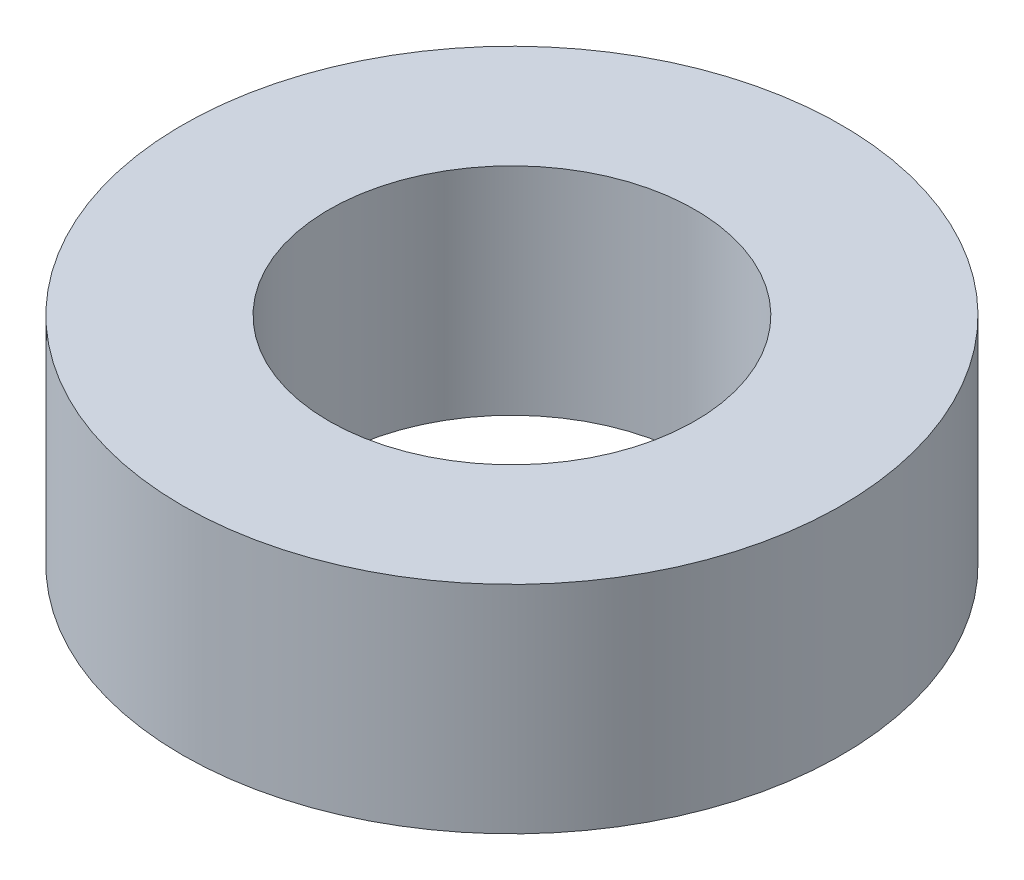
ISO-10303-21;
HEADER;
FILE_DESCRIPTION(('STEP AP214'),'2;1');
FILE_NAME('part.step','',(''),(''),'','','');
FILE_SCHEMA(('AUTOMOTIVE_DESIGN { 1 0 10303 214 1 1 1 1 }'));
ENDSEC;
DATA;
#1=APPLICATION_CONTEXT('core data for automotive mechanical design processes');
#2=APPLICATION_PROTOCOL_DEFINITION('international standard','automotive_design',2000,#1);
#3=PRODUCT_CONTEXT('',#1,'mechanical');
#4=PRODUCT('Part','Part','',(#3));
#5=PRODUCT_RELATED_PRODUCT_CATEGORY('part','',(#4));
#6=PRODUCT_DEFINITION_FORMATION('','',#4);
#7=PRODUCT_DEFINITION_CONTEXT('part definition',#1,'design');
#8=PRODUCT_DEFINITION('design','',#6,#7);
#9=PRODUCT_DEFINITION_SHAPE('','',#8);
#10=(LENGTH_UNIT() NAMED_UNIT(*) SI_UNIT(.MILLI.,.METRE.));
#11=(NAMED_UNIT(*) PLANE_ANGLE_UNIT() SI_UNIT($,.RADIAN.));
#12=(NAMED_UNIT(*) SI_UNIT($,.STERADIAN.) SOLID_ANGLE_UNIT());
#13=UNCERTAINTY_MEASURE_WITH_UNIT(LENGTH_MEASURE(1.E-05),#10,'distance_accuracy_value','');
#14=(GEOMETRIC_REPRESENTATION_CONTEXT(3) GLOBAL_UNCERTAINTY_ASSIGNED_CONTEXT((#13)) GLOBAL_UNIT_ASSIGNED_CONTEXT((#10,
#11,#12)) REPRESENTATION_CONTEXT('',''));
#15=CARTESIAN_POINT('',(0.,0.,0.));
#16=DIRECTION('',(0.,0.,1.));
#17=DIRECTION('',(1.,0.,0.));
#18=AXIS2_PLACEMENT_3D('',#15,#16,#17);
#19=CARTESIAN_POINT('',(0.,1.475,0.));
#20=DIRECTION('',(0.,1.,0.));
#21=DIRECTION('',(0.,0.,1.));
#22=AXIS2_PLACEMENT_3D('',#19,#20,#21);
#23=PLANE('',#22);
#24=CARTESIAN_POINT('',(0.,1.475,0.));
#25=DIRECTION('',(0.,1.,0.));
#26=DIRECTION('',(0.,0.,1.));
#27=AXIS2_PLACEMENT_3D('',#24,#25,#26);
#28=CIRCLE('',#27,4.5);
#29=CARTESIAN_POINT('',(0.,1.475,4.5));
#30=VERTEX_POINT('',#29);
#31=EDGE_CURVE('E10',#30,#30,#28,.T.);
#32=ORIENTED_EDGE('',*,*,#31,.T.);
#33=EDGE_LOOP('',(#32));
#34=FACE_BOUND('',#33,.T.);
#35=CARTESIAN_POINT('',(0.,1.475,0.));
#36=DIRECTION('',(0.,1.,0.));
#37=DIRECTION('',(0.,0.,1.));
#38=AXIS2_PLACEMENT_3D('',#35,#36,#37);
#39=CIRCLE('',#38,2.5);
#40=CARTESIAN_POINT('',(0.,1.475,2.5));
#41=VERTEX_POINT('',#40);
#42=EDGE_CURVE('E44',#41,#41,#39,.T.);
#43=ORIENTED_EDGE('',*,*,#42,.F.);
#44=EDGE_LOOP('',(#43));
#45=FACE_BOUND('',#44,.T.);
#46=ADVANCED_FACE('F33',(#34,#45),#23,.T.);
#47=CARTESIAN_POINT('',(0.,-1.475,0.));
#48=DIRECTION('',(0.,1.,0.));
#49=DIRECTION('',(0.,0.,1.));
#50=AXIS2_PLACEMENT_3D('',#47,#48,#49);
#51=PLANE('',#50);
#52=CARTESIAN_POINT('',(0.,-1.475,0.));
#53=DIRECTION('',(0.,1.,0.));
#54=DIRECTION('',(0.,0.,1.));
#55=AXIS2_PLACEMENT_3D('',#52,#53,#54);
#56=CIRCLE('',#55,4.5);
#57=CARTESIAN_POINT('',(0.,-1.475,4.5));
#58=VERTEX_POINT('',#57);
#59=EDGE_CURVE('E37',#58,#58,#56,.T.);
#60=ORIENTED_EDGE('',*,*,#59,.F.);
#61=EDGE_LOOP('',(#60));
#62=FACE_BOUND('',#61,.T.);
#63=CARTESIAN_POINT('',(0.,-1.475,0.));
#64=DIRECTION('',(0.,1.,0.));
#65=DIRECTION('',(0.,0.,1.));
#66=AXIS2_PLACEMENT_3D('',#63,#64,#65);
#67=CIRCLE('',#66,2.5);
#68=CARTESIAN_POINT('',(0.,-1.475,2.5));
#69=VERTEX_POINT('',#68);
#70=EDGE_CURVE('E46',#69,#69,#67,.T.);
#71=ORIENTED_EDGE('',*,*,#70,.T.);
#72=EDGE_LOOP('',(#71));
#73=FACE_BOUND('',#72,.T.);
#74=ADVANCED_FACE('F56',(#62,#73),#51,.F.);
#75=CARTESIAN_POINT('',(0.,1.475,0.));
#76=DIRECTION('',(0.,-1.,0.));
#77=DIRECTION('',(0.,0.,-1.));
#78=AXIS2_PLACEMENT_3D('',#75,#76,#77);
#79=CYLINDRICAL_SURFACE('',#78,4.5);
#80=ORIENTED_EDGE('',*,*,#31,.F.);
#81=EDGE_LOOP('',(#80));
#82=FACE_BOUND('',#81,.T.);
#83=ORIENTED_EDGE('',*,*,#59,.T.);
#84=EDGE_LOOP('',(#83));
#85=FACE_BOUND('',#84,.T.);
#86=ADVANCED_FACE('F35',(#82,#85),#79,.T.);
#87=CARTESIAN_POINT('',(0.,1.475,0.));
#88=DIRECTION('',(0.,-1.,0.));
#89=DIRECTION('',(0.,0.,-1.));
#90=AXIS2_PLACEMENT_3D('',#87,#88,#89);
#91=CYLINDRICAL_SURFACE('',#90,2.5);
#92=ORIENTED_EDGE('',*,*,#42,.T.);
#93=EDGE_LOOP('',(#92));
#94=FACE_BOUND('',#93,.T.);
#95=ORIENTED_EDGE('',*,*,#70,.F.);
#96=EDGE_LOOP('',(#95));
#97=FACE_BOUND('',#96,.T.);
#98=ADVANCED_FACE('F52',(#94,#97),#91,.F.);
#99=CLOSED_SHELL('',(#46,#74,#86,#98));
#100=MANIFOLD_SOLID_BREP('B2',#99);
#101=ADVANCED_BREP_SHAPE_REPRESENTATION('',(#18,#100),#14);
#102=SHAPE_DEFINITION_REPRESENTATION(#9,#101);
ENDSEC;
END-ISO-10303-21;
